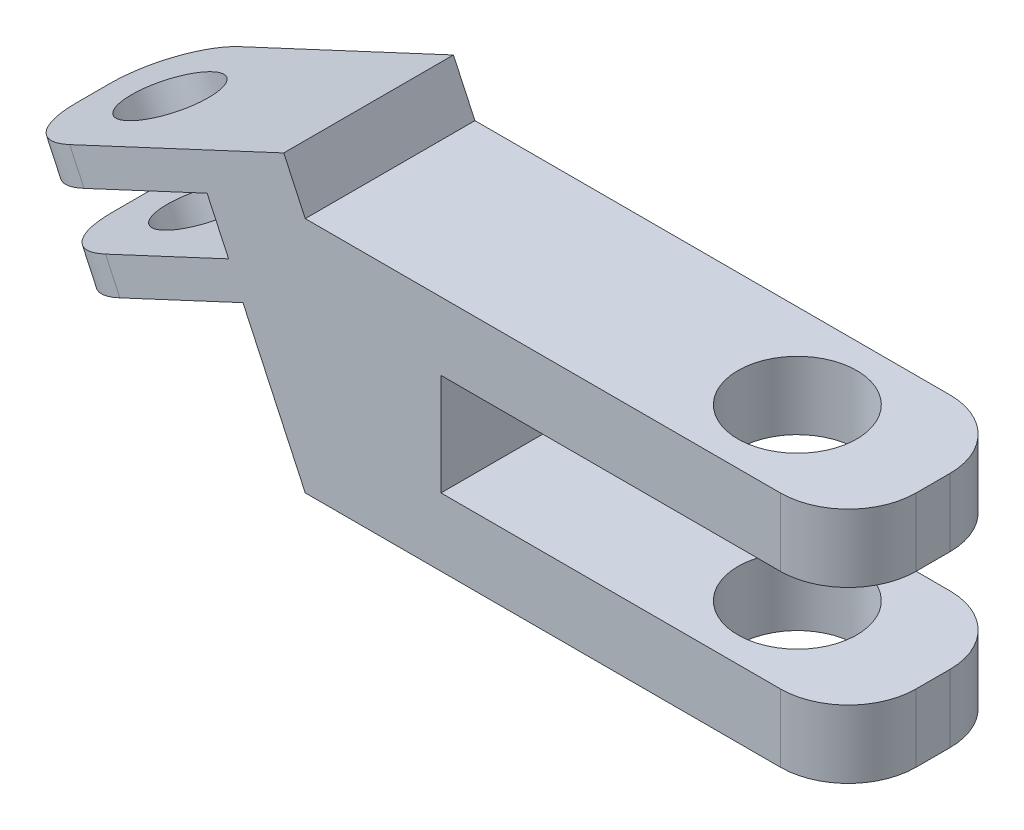
ISO-10303-21;
HEADER;
FILE_DESCRIPTION(('STEP AP214'),'2;1');
FILE_NAME('part.step','',(''),(''),'','','');
FILE_SCHEMA(('AUTOMOTIVE_DESIGN { 1 0 10303 214 1 1 1 1 }'));
ENDSEC;
DATA;
#1=APPLICATION_CONTEXT('core data for automotive mechanical design processes');
#2=APPLICATION_PROTOCOL_DEFINITION('international standard','automotive_design',2000,#1);
#3=PRODUCT_CONTEXT('',#1,'mechanical');
#4=PRODUCT('Part','Part','',(#3));
#5=PRODUCT_RELATED_PRODUCT_CATEGORY('part','',(#4));
#6=PRODUCT_DEFINITION_FORMATION('','',#4);
#7=PRODUCT_DEFINITION_CONTEXT('part definition',#1,'design');
#8=PRODUCT_DEFINITION('design','',#6,#7);
#9=PRODUCT_DEFINITION_SHAPE('','',#8);
#10=(LENGTH_UNIT() NAMED_UNIT(*) SI_UNIT(.MILLI.,.METRE.));
#11=(NAMED_UNIT(*) PLANE_ANGLE_UNIT() SI_UNIT($,.RADIAN.));
#12=(NAMED_UNIT(*) SI_UNIT($,.STERADIAN.) SOLID_ANGLE_UNIT());
#13=UNCERTAINTY_MEASURE_WITH_UNIT(LENGTH_MEASURE(1.E-05),#10,'distance_accuracy_value','');
#14=(GEOMETRIC_REPRESENTATION_CONTEXT(3) GLOBAL_UNCERTAINTY_ASSIGNED_CONTEXT((#13)) GLOBAL_UNIT_ASSIGNED_CONTEXT((#10,
#11,#12)) REPRESENTATION_CONTEXT('',''));
#15=CARTESIAN_POINT('',(0.,0.,0.));
#16=DIRECTION('',(0.,0.,1.));
#17=DIRECTION('',(1.,0.,0.));
#18=AXIS2_PLACEMENT_3D('',#15,#16,#17);
#19=CARTESIAN_POINT('',(16.,0.,2.5));
#20=DIRECTION('',(1.,0.,0.));
#21=DIRECTION('',(0.,0.,-1.));
#22=AXIS2_PLACEMENT_3D('',#19,#20,#21);
#23=PLANE('',#22);
#24=DIRECTION('',(0.,0.,-1.));
#25=VECTOR('',#24,1.);
#26=CARTESIAN_POINT('',(16.,-1.5,2.5));
#27=LINE('',#26,#25);
#28=CARTESIAN_POINT('',(16.,-1.5,0.5));
#29=VERTEX_POINT('',#28);
#30=CARTESIAN_POINT('',(16.,-1.5,-0.5));
#31=VERTEX_POINT('',#30);
#32=EDGE_CURVE('E220',#29,#31,#27,.T.);
#33=ORIENTED_EDGE('',*,*,#32,.F.);
#34=DIRECTION('',(0.,-1.,0.));
#35=VECTOR('',#34,1.);
#36=CARTESIAN_POINT('',(16.,0.,0.5));
#37=LINE('',#36,#35);
#38=CARTESIAN_POINT('',(16.,-3.5,0.5));
#39=VERTEX_POINT('',#38);
#40=EDGE_CURVE('E322',#29,#39,#37,.T.);
#41=ORIENTED_EDGE('',*,*,#40,.T.);
#42=DIRECTION('',(0.,0.,-1.));
#43=VECTOR('',#42,1.);
#44=CARTESIAN_POINT('',(16.,-3.5,2.5));
#45=LINE('',#44,#43);
#46=CARTESIAN_POINT('',(16.,-3.5,-0.5));
#47=VERTEX_POINT('',#46);
#48=EDGE_CURVE('E252',#39,#47,#45,.T.);
#49=ORIENTED_EDGE('',*,*,#48,.T.);
#50=DIRECTION('',(0.,-1.,0.));
#51=VECTOR('',#50,1.);
#52=CARTESIAN_POINT('',(16.,-1.5,-0.5));
#53=LINE('',#52,#51);
#54=EDGE_CURVE('E320',#47,#31,#53,.F.);
#55=ORIENTED_EDGE('',*,*,#54,.T.);
#56=EDGE_LOOP('',(#33,#41,#49,#55));
#57=FACE_BOUND('',#56,.T.);
#58=ADVANCED_FACE('F39',(#57),#23,.T.);
#59=CARTESIAN_POINT('',(0.,-1.5,2.5));
#60=DIRECTION('',(0.,-1.,0.));
#61=DIRECTION('',(0.,0.,-1.));
#62=AXIS2_PLACEMENT_3D('',#59,#60,#61);
#63=PLANE('',#62);
#64=CARTESIAN_POINT('',(12.,-1.5,0.));
#65=DIRECTION('',(0.,-1.,0.));
#66=DIRECTION('',(0.,0.,-1.));
#67=AXIS2_PLACEMENT_3D('',#64,#65,#66);
#68=CIRCLE('',#67,1.75);
#69=CARTESIAN_POINT('',(12.,-1.5,-1.75));
#70=VERTEX_POINT('',#69);
#71=EDGE_CURVE('E808',#70,#70,#68,.T.);
#72=ORIENTED_EDGE('',*,*,#71,.T.);
#73=EDGE_LOOP('',(#72));
#74=FACE_BOUND('',#73,.T.);
#75=DIRECTION('',(-1.,0.,0.));
#76=VECTOR('',#75,1.);
#77=CARTESIAN_POINT('',(0.,-1.5,2.5));
#78=LINE('',#77,#76);
#79=CARTESIAN_POINT('',(14.,-1.5,2.5));
#80=VERTEX_POINT('',#79);
#81=CARTESIAN_POINT('',(4.,-1.5,2.5));
#82=VERTEX_POINT('',#81);
#83=EDGE_CURVE('E199',#80,#82,#78,.T.);
#84=ORIENTED_EDGE('',*,*,#83,.F.);
#85=CARTESIAN_POINT('',(14.,-1.5,0.5));
#86=DIRECTION('',(0.,-1.,0.));
#87=DIRECTION('',(0.,0.,-1.));
#88=AXIS2_PLACEMENT_3D('',#85,#86,#87);
#89=CIRCLE('',#88,2.);
#90=EDGE_CURVE('E340',#80,#29,#89,.F.);
#91=ORIENTED_EDGE('',*,*,#90,.T.);
#92=ORIENTED_EDGE('',*,*,#32,.T.);
#93=CARTESIAN_POINT('',(14.,-1.5,-0.5));
#94=DIRECTION('',(0.,-1.,0.));
#95=DIRECTION('',(0.,0.,-1.));
#96=AXIS2_PLACEMENT_3D('',#93,#94,#95);
#97=CIRCLE('',#96,2.);
#98=CARTESIAN_POINT('',(14.,-1.5,-2.5));
#99=VERTEX_POINT('',#98);
#100=EDGE_CURVE('E338',#31,#99,#97,.F.);
#101=ORIENTED_EDGE('',*,*,#100,.T.);
#102=DIRECTION('',(-1.,0.,0.));
#103=VECTOR('',#102,1.);
#104=CARTESIAN_POINT('',(0.,-1.5,-2.5));
#105=LINE('',#104,#103);
#106=CARTESIAN_POINT('',(4.,-1.5,-2.5));
#107=VERTEX_POINT('',#106);
#108=EDGE_CURVE('E217',#99,#107,#105,.T.);
#109=ORIENTED_EDGE('',*,*,#108,.T.);
#110=DIRECTION('',(0.,0.,-1.));
#111=VECTOR('',#110,1.);
#112=CARTESIAN_POINT('',(4.,-1.5,2.5));
#113=LINE('',#112,#111);
#114=EDGE_CURVE('E214',#82,#107,#113,.T.);
#115=ORIENTED_EDGE('',*,*,#114,.F.);
#116=EDGE_LOOP('',(#84,#91,#92,#101,#109,#115));
#117=FACE_BOUND('',#116,.T.);
#118=ADVANCED_FACE('F215',(#74,#117),#63,.F.);
#119=CARTESIAN_POINT('',(4.,0.,2.5));
#120=DIRECTION('',(-1.,0.,0.));
#121=DIRECTION('',(0.,0.,1.));
#122=AXIS2_PLACEMENT_3D('',#119,#120,#121);
#123=PLANE('',#122);
#124=DIRECTION('',(0.,1.,0.));
#125=VECTOR('',#124,1.);
#126=CARTESIAN_POINT('',(4.,0.,-2.5));
#127=LINE('',#126,#125);
#128=CARTESIAN_POINT('',(4.,1.5,-2.5));
#129=VERTEX_POINT('',#128);
#130=EDGE_CURVE('E254',#107,#129,#127,.T.);
#131=ORIENTED_EDGE('',*,*,#130,.T.);
#132=DIRECTION('',(0.,0.,-1.));
#133=VECTOR('',#132,1.);
#134=CARTESIAN_POINT('',(4.,1.5,2.5));
#135=LINE('',#134,#133);
#136=CARTESIAN_POINT('',(4.,1.5,2.5));
#137=VERTEX_POINT('',#136);
#138=EDGE_CURVE('E221',#137,#129,#135,.T.);
#139=ORIENTED_EDGE('',*,*,#138,.F.);
#140=DIRECTION('',(0.,1.,0.));
#141=VECTOR('',#140,1.);
#142=CARTESIAN_POINT('',(4.,0.,2.5));
#143=LINE('',#142,#141);
#144=EDGE_CURVE('E205',#82,#137,#143,.T.);
#145=ORIENTED_EDGE('',*,*,#144,.F.);
#146=ORIENTED_EDGE('',*,*,#114,.T.);
#147=EDGE_LOOP('',(#131,#139,#145,#146));
#148=FACE_BOUND('',#147,.T.);
#149=ADVANCED_FACE('F223',(#148),#123,.F.);
#150=CARTESIAN_POINT('',(0.,1.5,2.5));
#151=DIRECTION('',(0.,1.,0.));
#152=DIRECTION('',(0.,0.,1.));
#153=AXIS2_PLACEMENT_3D('',#150,#151,#152);
#154=PLANE('',#153);
#155=CARTESIAN_POINT('',(12.,1.5,0.));
#156=DIRECTION('',(0.,1.,0.));
#157=DIRECTION('',(0.,0.,1.));
#158=AXIS2_PLACEMENT_3D('',#155,#156,#157);
#159=CIRCLE('',#158,1.75);
#160=CARTESIAN_POINT('',(12.,1.5,1.75));
#161=VERTEX_POINT('',#160);
#162=EDGE_CURVE('E817',#161,#161,#159,.T.);
#163=ORIENTED_EDGE('',*,*,#162,.T.);
#164=EDGE_LOOP('',(#163));
#165=FACE_BOUND('',#164,.T.);
#166=DIRECTION('',(1.,0.,0.));
#167=VECTOR('',#166,1.);
#168=CARTESIAN_POINT('',(0.,1.5,-2.5));
#169=LINE('',#168,#167);
#170=CARTESIAN_POINT('',(14.,1.5,-2.5));
#171=VERTEX_POINT('',#170);
#172=EDGE_CURVE('E257',#129,#171,#169,.T.);
#173=ORIENTED_EDGE('',*,*,#172,.T.);
#174=CARTESIAN_POINT('',(14.,1.5,-0.5));
#175=DIRECTION('',(0.,1.,0.));
#176=DIRECTION('',(0.,0.,1.));
#177=AXIS2_PLACEMENT_3D('',#174,#175,#176);
#178=CIRCLE('',#177,2.);
#179=CARTESIAN_POINT('',(16.,1.5,-0.5));
#180=VERTEX_POINT('',#179);
#181=EDGE_CURVE('E354',#171,#180,#178,.F.);
#182=ORIENTED_EDGE('',*,*,#181,.T.);
#183=DIRECTION('',(0.,0.,-1.));
#184=VECTOR('',#183,1.);
#185=CARTESIAN_POINT('',(16.,1.5,2.5));
#186=LINE('',#185,#184);
#187=CARTESIAN_POINT('',(16.,1.5,0.5));
#188=VERTEX_POINT('',#187);
#189=EDGE_CURVE('E314',#188,#180,#186,.T.);
#190=ORIENTED_EDGE('',*,*,#189,.F.);
#191=CARTESIAN_POINT('',(14.,1.5,0.5));
#192=DIRECTION('',(0.,1.,0.));
#193=DIRECTION('',(0.,0.,1.));
#194=AXIS2_PLACEMENT_3D('',#191,#192,#193);
#195=CIRCLE('',#194,2.);
#196=CARTESIAN_POINT('',(14.,1.5,2.5));
#197=VERTEX_POINT('',#196);
#198=EDGE_CURVE('E352',#188,#197,#195,.F.);
#199=ORIENTED_EDGE('',*,*,#198,.T.);
#200=DIRECTION('',(1.,0.,0.));
#201=VECTOR('',#200,1.);
#202=CARTESIAN_POINT('',(0.,1.5,2.5));
#203=LINE('',#202,#201);
#204=EDGE_CURVE('E226',#137,#197,#203,.T.);
#205=ORIENTED_EDGE('',*,*,#204,.F.);
#206=ORIENTED_EDGE('',*,*,#138,.T.);
#207=EDGE_LOOP('',(#173,#182,#190,#199,#205,#206));
#208=FACE_BOUND('',#207,.T.);
#209=ADVANCED_FACE('F455',(#165,#208),#154,.F.);
#210=CARTESIAN_POINT('',(16.,0.,2.5));
#211=DIRECTION('',(1.,0.,0.));
#212=DIRECTION('',(0.,0.,-1.));
#213=AXIS2_PLACEMENT_3D('',#210,#211,#212);
#214=PLANE('',#213);
#215=ORIENTED_EDGE('',*,*,#189,.T.);
#216=DIRECTION('',(0.,-1.,0.));
#217=VECTOR('',#216,1.);
#218=CARTESIAN_POINT('',(16.,3.5,-0.5));
#219=LINE('',#218,#217);
#220=CARTESIAN_POINT('',(16.,3.5,-0.5));
#221=VERTEX_POINT('',#220);
#222=EDGE_CURVE('E359',#180,#221,#219,.F.);
#223=ORIENTED_EDGE('',*,*,#222,.T.);
#224=DIRECTION('',(0.,0.,-1.));
#225=VECTOR('',#224,1.);
#226=CARTESIAN_POINT('',(16.,3.5,2.5));
#227=LINE('',#226,#225);
#228=CARTESIAN_POINT('',(16.,3.5,0.5));
#229=VERTEX_POINT('',#228);
#230=EDGE_CURVE('E311',#229,#221,#227,.T.);
#231=ORIENTED_EDGE('',*,*,#230,.F.);
#232=DIRECTION('',(0.,-1.,0.));
#233=VECTOR('',#232,1.);
#234=CARTESIAN_POINT('',(16.,0.,0.5));
#235=LINE('',#234,#233);
#236=EDGE_CURVE('E356',#229,#188,#235,.T.);
#237=ORIENTED_EDGE('',*,*,#236,.T.);
#238=EDGE_LOOP('',(#215,#223,#231,#237));
#239=FACE_BOUND('',#238,.T.);
#240=ADVANCED_FACE('F467',(#239),#214,.T.);
#241=CARTESIAN_POINT('',(0.,3.5,2.5));
#242=DIRECTION('',(0.,1.,0.));
#243=DIRECTION('',(0.,0.,1.));
#244=AXIS2_PLACEMENT_3D('',#241,#242,#243);
#245=PLANE('',#244);
#246=CARTESIAN_POINT('',(12.,3.49999999999999,0.));
#247=DIRECTION('',(0.,1.,0.));
#248=DIRECTION('',(-1.,0.,0.));
#249=AXIS2_PLACEMENT_3D('',#246,#247,#248);
#250=CIRCLE('',#249,1.75);
#251=CARTESIAN_POINT('',(10.25,3.49999999999999,0.));
#252=VERTEX_POINT('',#251);
#253=EDGE_CURVE('E821',#252,#252,#250,.T.);
#254=ORIENTED_EDGE('',*,*,#253,.F.);
#255=EDGE_LOOP('',(#254));
#256=FACE_BOUND('',#255,.T.);
#257=ORIENTED_EDGE('',*,*,#230,.T.);
#258=CARTESIAN_POINT('',(14.,3.5,-0.5));
#259=DIRECTION('',(0.,1.,0.));
#260=DIRECTION('',(0.,0.,1.));
#261=AXIS2_PLACEMENT_3D('',#258,#259,#260);
#262=CIRCLE('',#261,2.);
#263=CARTESIAN_POINT('',(14.,3.5,-2.5));
#264=VERTEX_POINT('',#263);
#265=EDGE_CURVE('E363',#221,#264,#262,.T.);
#266=ORIENTED_EDGE('',*,*,#265,.T.);
#267=DIRECTION('',(1.,0.,0.));
#268=VECTOR('',#267,1.);
#269=CARTESIAN_POINT('',(0.,3.5,-2.5));
#270=LINE('',#269,#268);
#271=CARTESIAN_POINT('',(0.,3.5,-2.5));
#272=VERTEX_POINT('',#271);
#273=EDGE_CURVE('E260',#272,#264,#270,.T.);
#274=ORIENTED_EDGE('',*,*,#273,.F.);
#275=DIRECTION('',(0.,0.,-1.));
#276=VECTOR('',#275,1.);
#277=CARTESIAN_POINT('',(0.,3.5,2.5));
#278=LINE('',#277,#276);
#279=CARTESIAN_POINT('',(0.,3.5,2.5));
#280=VERTEX_POINT('',#279);
#281=EDGE_CURVE('E309',#280,#272,#278,.T.);
#282=ORIENTED_EDGE('',*,*,#281,.F.);
#283=DIRECTION('',(1.,0.,0.));
#284=VECTOR('',#283,1.);
#285=CARTESIAN_POINT('',(0.,3.5,2.5));
#286=LINE('',#285,#284);
#287=CARTESIAN_POINT('',(14.,3.5,2.5));
#288=VERTEX_POINT('',#287);
#289=EDGE_CURVE('E228',#280,#288,#286,.T.);
#290=ORIENTED_EDGE('',*,*,#289,.T.);
#291=CARTESIAN_POINT('',(14.,3.5,0.5));
#292=DIRECTION('',(0.,1.,0.));
#293=DIRECTION('',(0.,0.,1.));
#294=AXIS2_PLACEMENT_3D('',#291,#292,#293);
#295=CIRCLE('',#294,2.);
#296=EDGE_CURVE('E361',#288,#229,#295,.T.);
#297=ORIENTED_EDGE('',*,*,#296,.T.);
#298=EDGE_LOOP('',(#257,#266,#274,#282,#290,#297));
#299=FACE_BOUND('',#298,.T.);
#300=ADVANCED_FACE('F464',(#256,#299),#245,.T.);
#301=CARTESIAN_POINT('',(1.3405777754582,0.625121683048543,2.5));
#302=DIRECTION('',(0.906307787036652,0.422618261740695,0.));
#303=DIRECTION('',(-0.422618261740695,0.906307787036652,0.));
#304=AXIS2_PLACEMENT_3D('',#301,#302,#303);
#305=PLANE('',#304);
#306=DIRECTION('',(0.422618261740695,-0.906307787036652,0.));
#307=VECTOR('',#306,1.);
#308=CARTESIAN_POINT('',(1.3405777754582,0.625121683048543,-2.5));
#309=LINE('',#308,#307);
#310=CARTESIAN_POINT('',(-0.633927392611042,4.85946168055498,-2.5));
#311=VERTEX_POINT('',#310);
#312=EDGE_CURVE('E263',#311,#272,#309,.T.);
#313=ORIENTED_EDGE('',*,*,#312,.F.);
#314=DIRECTION('',(0.,0.,-1.));
#315=VECTOR('',#314,1.);
#316=CARTESIAN_POINT('',(-0.633927392611042,4.85946168055498,2.5));
#317=LINE('',#316,#315);
#318=CARTESIAN_POINT('',(-0.633927392611042,4.85946168055498,2.5));
#319=VERTEX_POINT('',#318);
#320=EDGE_CURVE('E306',#319,#311,#317,.T.);
#321=ORIENTED_EDGE('',*,*,#320,.F.);
#322=DIRECTION('',(0.422618261740695,-0.906307787036652,0.));
#323=VECTOR('',#322,1.);
#324=CARTESIAN_POINT('',(1.3405777754582,0.625121683048543,2.5));
#325=LINE('',#324,#323);
#326=EDGE_CURVE('E234',#319,#280,#325,.T.);
#327=ORIENTED_EDGE('',*,*,#326,.T.);
#328=ORIENTED_EDGE('',*,*,#281,.T.);
#329=EDGE_LOOP('',(#313,#321,#327,#328));
#330=FACE_BOUND('',#329,.T.);
#331=ADVANCED_FACE('F475',(#330),#305,.T.);
#332=CARTESIAN_POINT('',(-1.97450516806924,4.23433999750644,2.5));
#333=DIRECTION('',(-0.422618261740695,0.906307787036652,0.));
#334=DIRECTION('',(-0.906307787036652,-0.422618261740695,0.));
#335=AXIS2_PLACEMENT_3D('',#332,#333,#334);
#336=PLANE('',#335);
#337=CARTESIAN_POINT('',(-6.48716019815572,2.13005439836546,0.));
#338=DIRECTION('',(-0.422618261740695,0.906307787036652,0.));
#339=DIRECTION('',(-0.906307787036652,-0.422618261740695,0.));
#340=AXIS2_PLACEMENT_3D('',#337,#338,#339);
#341=CIRCLE('',#340,1.25);
#342=CARTESIAN_POINT('',(-7.62004493195154,1.6017815711896,0.));
#343=VERTEX_POINT('',#342);
#344=EDGE_CURVE('E255',#343,#343,#341,.T.);
#345=ORIENTED_EDGE('',*,*,#344,.F.);
#346=EDGE_LOOP('',(#345));
#347=FACE_BOUND('',#346,.T.);
#348=DIRECTION('',(0.906307787036652,0.422618261740695,0.));
#349=VECTOR('',#348,1.);
#350=CARTESIAN_POINT('',(-1.97450516806924,4.23433999750644,-2.5));
#351=LINE('',#350,#349);
#352=CARTESIAN_POINT('',(-6.94031409167405,1.91874526749511,-2.5));
#353=VERTEX_POINT('',#352);
#354=EDGE_CURVE('E266',#353,#311,#351,.T.);
#355=ORIENTED_EDGE('',*,*,#354,.F.);
#356=CARTESIAN_POINT('',(-6.94031409167405,1.91874526749512,-0.5));
#357=DIRECTION('',(-0.422618261740695,0.906307787036652,0.));
#358=DIRECTION('',(-0.906307787036652,-0.422618261740695,0.));
#359=AXIS2_PLACEMENT_3D('',#356,#357,#358);
#360=CIRCLE('',#359,2.);
#361=CARTESIAN_POINT('',(-8.75292966574735,1.07350874401373,-0.5));
#362=VERTEX_POINT('',#361);
#363=EDGE_CURVE('E11',#353,#362,#360,.T.);
#364=ORIENTED_EDGE('',*,*,#363,.T.);
#365=DIRECTION('',(0.,0.,-1.));
#366=VECTOR('',#365,1.);
#367=CARTESIAN_POINT('',(-8.75292966574735,1.07350874401373,2.5));
#368=LINE('',#367,#366);
#369=CARTESIAN_POINT('',(-8.75292966574735,1.07350874401373,0.5));
#370=VERTEX_POINT('',#369);
#371=EDGE_CURVE('E304',#370,#362,#368,.T.);
#372=ORIENTED_EDGE('',*,*,#371,.F.);
#373=CARTESIAN_POINT('',(-6.94031409167405,1.91874526749512,0.5));
#374=DIRECTION('',(-0.422618261740695,0.906307787036652,0.));
#375=DIRECTION('',(-0.906307787036652,-0.422618261740695,0.));
#376=AXIS2_PLACEMENT_3D('',#373,#374,#375);
#377=CIRCLE('',#376,2.);
#378=CARTESIAN_POINT('',(-6.94031409167405,1.91874526749511,2.5));
#379=VERTEX_POINT('',#378);
#380=EDGE_CURVE('E47',#370,#379,#377,.T.);
#381=ORIENTED_EDGE('',*,*,#380,.T.);
#382=DIRECTION('',(0.906307787036652,0.422618261740695,0.));
#383=VECTOR('',#382,1.);
#384=CARTESIAN_POINT('',(-1.97450516806924,4.23433999750644,2.5));
#385=LINE('',#384,#383);
#386=EDGE_CURVE('E237',#379,#319,#385,.T.);
#387=ORIENTED_EDGE('',*,*,#386,.T.);
#388=ORIENTED_EDGE('',*,*,#320,.T.);
#389=EDGE_LOOP('',(#355,#364,#372,#381,#387,#388));
#390=FACE_BOUND('',#389,.T.);
#391=ADVANCED_FACE('F387',(#347,#390),#336,.T.);
#392=CARTESIAN_POINT('',(-6.77842449767811,-3.16083125349271,2.5));
#393=DIRECTION('',(0.906307787036652,0.422618261740695,0.));
#394=DIRECTION('',(-0.422618261740695,0.906307787036652,0.));
#395=AXIS2_PLACEMENT_3D('',#392,#393,#394);
#396=PLANE('',#395);
#397=ORIENTED_EDGE('',*,*,#371,.T.);
#398=DIRECTION('',(0.422618261740695,-0.906307787036652,0.));
#399=VECTOR('',#398,1.);
#400=CARTESIAN_POINT('',(-6.77842449767811,-3.16083125349271,-0.5));
#401=LINE('',#400,#399);
#402=CARTESIAN_POINT('',(-8.33031140400666,0.167200956977075,-0.5));
#403=VERTEX_POINT('',#402);
#404=EDGE_CURVE('E379',#362,#403,#401,.T.);
#405=ORIENTED_EDGE('',*,*,#404,.T.);
#406=DIRECTION('',(0.,0.,-1.));
#407=VECTOR('',#406,1.);
#408=CARTESIAN_POINT('',(-8.33031140400666,0.167200956977075,2.5));
#409=LINE('',#408,#407);
#410=CARTESIAN_POINT('',(-8.33031140400666,0.167200956977075,0.5));
#411=VERTEX_POINT('',#410);
#412=EDGE_CURVE('E301',#411,#403,#409,.T.);
#413=ORIENTED_EDGE('',*,*,#412,.F.);
#414=DIRECTION('',(0.422618261740695,-0.906307787036652,0.));
#415=VECTOR('',#414,1.);
#416=CARTESIAN_POINT('',(-8.75292966574735,1.07350874401373,0.5));
#417=LINE('',#416,#415);
#418=EDGE_CURVE('E59',#411,#370,#417,.F.);
#419=ORIENTED_EDGE('',*,*,#418,.T.);
#420=EDGE_LOOP('',(#397,#405,#413,#419));
#421=FACE_BOUND('',#420,.T.);
#422=ADVANCED_FACE('F397',(#421),#396,.F.);
#423=CARTESIAN_POINT('',(-1.55188690632855,3.32803221046979,2.5));
#424=DIRECTION('',(-0.422618261740695,0.906307787036652,0.));
#425=DIRECTION('',(-0.906307787036652,-0.422618261740695,0.));
#426=AXIS2_PLACEMENT_3D('',#423,#424,#425);
#427=PLANE('',#426);
#428=CARTESIAN_POINT('',(-6.06454193641503,1.22374661132881,0.));
#429=DIRECTION('',(-0.422618261740695,0.906307787036652,0.));
#430=DIRECTION('',(-0.906307787036652,-0.422618261740695,0.));
#431=AXIS2_PLACEMENT_3D('',#428,#429,#430);
#432=CIRCLE('',#431,1.25);
#433=CARTESIAN_POINT('',(-7.19742667021084,0.695473784152945,0.));
#434=VERTEX_POINT('',#433);
#435=EDGE_CURVE('E804',#434,#434,#432,.T.);
#436=ORIENTED_EDGE('',*,*,#435,.T.);
#437=EDGE_LOOP('',(#436));
#438=FACE_BOUND('',#437,.T.);
#439=ORIENTED_EDGE('',*,*,#412,.T.);
#440=CARTESIAN_POINT('',(-6.51769582993336,1.01243748045847,-0.5));
#441=DIRECTION('',(-0.422618261740695,0.906307787036652,0.));
#442=DIRECTION('',(-0.906307787036652,-0.422618261740695,0.));
#443=AXIS2_PLACEMENT_3D('',#440,#441,#442);
#444=CIRCLE('',#443,2.);
#445=CARTESIAN_POINT('',(-6.51769582993336,1.01243748045846,-2.5));
#446=VERTEX_POINT('',#445);
#447=EDGE_CURVE('E384',#403,#446,#444,.F.);
#448=ORIENTED_EDGE('',*,*,#447,.T.);
#449=DIRECTION('',(0.906307787036652,0.422618261740695,0.));
#450=VECTOR('',#449,1.);
#451=CARTESIAN_POINT('',(-1.55188690632855,3.32803221046979,-2.5));
#452=LINE('',#451,#450);
#453=CARTESIAN_POINT('',(-2.89246468178675,2.70291052742124,-2.5));
#454=VERTEX_POINT('',#453);
#455=EDGE_CURVE('E268',#446,#454,#452,.T.);
#456=ORIENTED_EDGE('',*,*,#455,.T.);
#457=DIRECTION('',(0.,0.,-1.));
#458=VECTOR('',#457,1.);
#459=CARTESIAN_POINT('',(-2.89246468178675,2.70291052742124,2.5));
#460=LINE('',#459,#458);
#461=CARTESIAN_POINT('',(-2.89246468178675,2.70291052742124,2.5));
#462=VERTEX_POINT('',#461);
#463=EDGE_CURVE('E298',#462,#454,#460,.T.);
#464=ORIENTED_EDGE('',*,*,#463,.F.);
#465=DIRECTION('',(0.906307787036652,0.422618261740695,0.));
#466=VECTOR('',#465,1.);
#467=CARTESIAN_POINT('',(-1.55188690632855,3.32803221046979,2.5));
#468=LINE('',#467,#466);
#469=CARTESIAN_POINT('',(-6.51769582993336,1.01243748045846,2.5));
#470=VERTEX_POINT('',#469);
#471=EDGE_CURVE('E239',#470,#462,#468,.T.);
#472=ORIENTED_EDGE('',*,*,#471,.F.);
#473=CARTESIAN_POINT('',(-6.51769582993336,1.01243748045847,0.5));
#474=DIRECTION('',(-0.422618261740695,0.906307787036652,0.));
#475=DIRECTION('',(-0.906307787036652,-0.422618261740695,0.));
#476=AXIS2_PLACEMENT_3D('',#473,#474,#475);
#477=CIRCLE('',#476,2.);
#478=EDGE_CURVE('E382',#470,#411,#477,.F.);
#479=ORIENTED_EDGE('',*,*,#478,.T.);
#480=EDGE_LOOP('',(#439,#448,#456,#464,#472,#479));
#481=FACE_BOUND('',#480,.T.);
#482=ADVANCED_FACE('F395',(#438,#481),#427,.F.);
#483=CARTESIAN_POINT('',(-1.3405777754582,-0.625121683048543,2.5));
#484=DIRECTION('',(0.906307787036652,0.422618261740695,0.));
#485=DIRECTION('',(-0.422618261740695,0.906307787036652,0.));
#486=AXIS2_PLACEMENT_3D('',#483,#484,#485);
#487=PLANE('',#486);
#488=DIRECTION('',(0.422618261740695,-0.906307787036652,0.));
#489=VECTOR('',#488,1.);
#490=CARTESIAN_POINT('',(-1.3405777754582,-0.625121683048543,-2.5));
#491=LINE('',#490,#489);
#492=CARTESIAN_POINT('',(-2.25853728917571,1.34344884686626,-2.5));
#493=VERTEX_POINT('',#492);
#494=EDGE_CURVE('E270',#454,#493,#491,.T.);
#495=ORIENTED_EDGE('',*,*,#494,.T.);
#496=DIRECTION('',(0.,0.,-1.));
#497=VECTOR('',#496,1.);
#498=CARTESIAN_POINT('',(-2.25853728917571,1.34344884686626,2.5));
#499=LINE('',#498,#497);
#500=CARTESIAN_POINT('',(-2.25853728917571,1.34344884686626,2.5));
#501=VERTEX_POINT('',#500);
#502=EDGE_CURVE('E295',#501,#493,#499,.T.);
#503=ORIENTED_EDGE('',*,*,#502,.F.);
#504=DIRECTION('',(0.422618261740695,-0.906307787036652,0.));
#505=VECTOR('',#504,1.);
#506=CARTESIAN_POINT('',(-1.3405777754582,-0.625121683048543,2.5));
#507=LINE('',#506,#505);
#508=EDGE_CURVE('E241',#462,#501,#507,.T.);
#509=ORIENTED_EDGE('',*,*,#508,.F.);
#510=ORIENTED_EDGE('',*,*,#463,.T.);
#511=EDGE_LOOP('',(#495,#503,#509,#510));
#512=FACE_BOUND('',#511,.T.);
#513=ADVANCED_FACE('F409',(#512),#487,.F.);
#514=CARTESIAN_POINT('',(-0.917959513717507,1.96857052991481,2.5));
#515=DIRECTION('',(0.422618261740695,-0.906307787036652,0.));
#516=DIRECTION('',(0.906307787036652,0.422618261740695,0.));
#517=AXIS2_PLACEMENT_3D('',#514,#515,#516);
#518=PLANE('',#517);
#519=CARTESIAN_POINT('',(-5.43061454380399,-0.135715069226168,0.));
#520=DIRECTION('',(0.422618261740695,-0.906307787036652,0.));
#521=DIRECTION('',(0.906307787036652,0.422618261740695,0.));
#522=AXIS2_PLACEMENT_3D('',#519,#520,#521);
#523=CIRCLE('',#522,1.25);
#524=CARTESIAN_POINT('',(-4.29772981000817,0.392557757949701,0.));
#525=VERTEX_POINT('',#524);
#526=EDGE_CURVE('E803',#525,#525,#523,.T.);
#527=ORIENTED_EDGE('',*,*,#526,.T.);
#528=EDGE_LOOP('',(#527));
#529=FACE_BOUND('',#528,.T.);
#530=DIRECTION('',(-0.906307787036652,-0.422618261740695,0.));
#531=VECTOR('',#530,1.);
#532=CARTESIAN_POINT('',(-0.917959513717507,1.96857052991481,-2.5));
#533=LINE('',#532,#531);
#534=CARTESIAN_POINT('',(-5.88376843732231,-0.347024200096515,-2.5));
#535=VERTEX_POINT('',#534);
#536=EDGE_CURVE('E272',#493,#535,#533,.T.);
#537=ORIENTED_EDGE('',*,*,#536,.T.);
#538=CARTESIAN_POINT('',(-5.88376843732231,-0.347024200096516,-0.5));
#539=DIRECTION('',(0.422618261740695,-0.906307787036652,0.));
#540=DIRECTION('',(0.906307787036652,0.422618261740695,0.));
#541=AXIS2_PLACEMENT_3D('',#538,#539,#540);
#542=CIRCLE('',#541,2.);
#543=CARTESIAN_POINT('',(-7.69638401139562,-1.19226072357791,-0.5));
#544=VERTEX_POINT('',#543);
#545=EDGE_CURVE('E376',#535,#544,#542,.F.);
#546=ORIENTED_EDGE('',*,*,#545,.T.);
#547=DIRECTION('',(0.,0.,-1.));
#548=VECTOR('',#547,1.);
#549=CARTESIAN_POINT('',(-7.69638401139562,-1.19226072357791,2.5));
#550=LINE('',#549,#548);
#551=CARTESIAN_POINT('',(-7.69638401139562,-1.19226072357791,0.5));
#552=VERTEX_POINT('',#551);
#553=EDGE_CURVE('E292',#552,#544,#550,.T.);
#554=ORIENTED_EDGE('',*,*,#553,.F.);
#555=CARTESIAN_POINT('',(-5.88376843732231,-0.347024200096515,0.5));
#556=DIRECTION('',(0.422618261740695,-0.906307787036652,0.));
#557=DIRECTION('',(0.906307787036652,0.422618261740695,0.));
#558=AXIS2_PLACEMENT_3D('',#555,#556,#557);
#559=CIRCLE('',#558,2.);
#560=CARTESIAN_POINT('',(-5.88376843732231,-0.347024200096515,2.5));
#561=VERTEX_POINT('',#560);
#562=EDGE_CURVE('E374',#552,#561,#559,.F.);
#563=ORIENTED_EDGE('',*,*,#562,.T.);
#564=DIRECTION('',(-0.906307787036652,-0.422618261740695,0.));
#565=VECTOR('',#564,1.);
#566=CARTESIAN_POINT('',(-0.917959513717507,1.96857052991481,2.5));
#567=LINE('',#566,#565);
#568=EDGE_CURVE('E243',#501,#561,#567,.T.);
#569=ORIENTED_EDGE('',*,*,#568,.F.);
#570=ORIENTED_EDGE('',*,*,#502,.T.);
#571=EDGE_LOOP('',(#537,#546,#554,#563,#569,#570));
#572=FACE_BOUND('',#571,.T.);
#573=ADVANCED_FACE('F413',(#529,#572),#518,.F.);
#574=CARTESIAN_POINT('',(-6.77842449767812,-3.1608312534927,2.5));
#575=DIRECTION('',(0.906307787036653,0.422618261740693,0.));
#576=DIRECTION('',(-0.422618261740693,0.906307787036653,0.));
#577=AXIS2_PLACEMENT_3D('',#574,#575,#576);
#578=PLANE('',#577);
#579=ORIENTED_EDGE('',*,*,#553,.T.);
#580=DIRECTION('',(0.422618261740693,-0.906307787036653,0.));
#581=VECTOR('',#580,1.);
#582=CARTESIAN_POINT('',(-6.77842449767812,-3.1608312534927,-0.5));
#583=LINE('',#582,#581);
#584=CARTESIAN_POINT('',(-7.27376574965492,-2.09856851061456,-0.5));
#585=VERTEX_POINT('',#584);
#586=EDGE_CURVE('E367',#544,#585,#583,.T.);
#587=ORIENTED_EDGE('',*,*,#586,.T.);
#588=DIRECTION('',(0.,0.,-1.));
#589=VECTOR('',#588,1.);
#590=CARTESIAN_POINT('',(-7.27376574965492,-2.09856851061456,2.5));
#591=LINE('',#590,#589);
#592=CARTESIAN_POINT('',(-7.27376574965492,-2.09856851061456,0.5));
#593=VERTEX_POINT('',#592);
#594=EDGE_CURVE('E289',#593,#585,#591,.T.);
#595=ORIENTED_EDGE('',*,*,#594,.F.);
#596=DIRECTION('',(0.422618261740693,-0.906307787036653,0.));
#597=VECTOR('',#596,1.);
#598=CARTESIAN_POINT('',(-7.69638401139562,-1.19226072357791,0.5));
#599=LINE('',#598,#597);
#600=EDGE_CURVE('E365',#593,#552,#599,.F.);
#601=ORIENTED_EDGE('',*,*,#600,.T.);
#602=EDGE_LOOP('',(#579,#587,#595,#601));
#603=FACE_BOUND('',#602,.T.);
#604=ADVANCED_FACE('F427',(#603),#578,.F.);
#605=CARTESIAN_POINT('',(-0.495341251976811,1.06226274287815,2.5));
#606=DIRECTION('',(-0.422618261740695,0.906307787036652,0.));
#607=DIRECTION('',(-0.906307787036652,-0.422618261740695,0.));
#608=AXIS2_PLACEMENT_3D('',#605,#606,#607);
#609=PLANE('',#608);
#610=CARTESIAN_POINT('',(-5.00799628206329,-1.04202285626282,0.));
#611=DIRECTION('',(0.422618261740694,-0.906307787036652,0.));
#612=DIRECTION('',(0.906307787036652,0.422618261740694,0.));
#613=AXIS2_PLACEMENT_3D('',#610,#611,#612);
#614=CIRCLE('',#613,1.25);
#615=CARTESIAN_POINT('',(-3.87511154826748,-0.513750029086948,0.));
#616=VERTEX_POINT('',#615);
#617=EDGE_CURVE('E800',#616,#616,#614,.T.);
#618=ORIENTED_EDGE('',*,*,#617,.F.);
#619=EDGE_LOOP('',(#618));
#620=FACE_BOUND('',#619,.T.);
#621=ORIENTED_EDGE('',*,*,#594,.T.);
#622=CARTESIAN_POINT('',(-5.46115017558162,-1.25333198713317,-0.5));
#623=DIRECTION('',(-0.422618261740695,0.906307787036652,0.));
#624=DIRECTION('',(-0.906307787036652,-0.422618261740695,0.));
#625=AXIS2_PLACEMENT_3D('',#622,#623,#624);
#626=CIRCLE('',#625,2.);
#627=CARTESIAN_POINT('',(-5.46115017558162,-1.25333198713317,-2.5));
#628=VERTEX_POINT('',#627);
#629=EDGE_CURVE('E372',#585,#628,#626,.F.);
#630=ORIENTED_EDGE('',*,*,#629,.T.);
#631=DIRECTION('',(0.906307787036652,0.422618261740695,0.));
#632=VECTOR('',#631,1.);
#633=CARTESIAN_POINT('',(-0.495341251976811,1.06226274287815,-2.5));
#634=LINE('',#633,#632);
#635=CARTESIAN_POINT('',(-1.83591902743501,0.437141059829612,-2.5));
#636=VERTEX_POINT('',#635);
#637=EDGE_CURVE('E275',#628,#636,#634,.T.);
#638=ORIENTED_EDGE('',*,*,#637,.T.);
#639=DIRECTION('',(0.,0.,-1.));
#640=VECTOR('',#639,1.);
#641=CARTESIAN_POINT('',(-1.83591902743501,0.437141059829612,2.5));
#642=LINE('',#641,#640);
#643=CARTESIAN_POINT('',(-1.83591902743501,0.437141059829612,2.5));
#644=VERTEX_POINT('',#643);
#645=EDGE_CURVE('E286',#644,#636,#642,.T.);
#646=ORIENTED_EDGE('',*,*,#645,.F.);
#647=DIRECTION('',(0.906307787036652,0.422618261740695,0.));
#648=VECTOR('',#647,1.);
#649=CARTESIAN_POINT('',(-0.495341251976811,1.06226274287815,2.5));
#650=LINE('',#649,#648);
#651=CARTESIAN_POINT('',(-5.46115017558162,-1.25333198713317,2.5));
#652=VERTEX_POINT('',#651);
#653=EDGE_CURVE('E246',#652,#644,#650,.T.);
#654=ORIENTED_EDGE('',*,*,#653,.F.);
#655=CARTESIAN_POINT('',(-5.46115017558162,-1.25333198713317,0.5));
#656=DIRECTION('',(-0.422618261740695,0.906307787036652,0.));
#657=DIRECTION('',(-0.906307787036652,-0.422618261740695,0.));
#658=AXIS2_PLACEMENT_3D('',#655,#656,#657);
#659=CIRCLE('',#658,2.);
#660=EDGE_CURVE('E370',#652,#593,#659,.F.);
#661=ORIENTED_EDGE('',*,*,#660,.T.);
#662=EDGE_LOOP('',(#621,#630,#638,#646,#654,#661));
#663=FACE_BOUND('',#662,.T.);
#664=ADVANCED_FACE('F424',(#620,#663),#609,.F.);
#665=CARTESIAN_POINT('',(-1.3405777754582,-0.625121683048542,2.5));
#666=DIRECTION('',(0.906307787036652,0.422618261740695,0.));
#667=DIRECTION('',(-0.422618261740695,0.906307787036652,0.));
#668=AXIS2_PLACEMENT_3D('',#665,#666,#667);
#669=PLANE('',#668);
#670=DIRECTION('',(0.422618261740695,-0.906307787036652,0.));
#671=VECTOR('',#670,1.);
#672=CARTESIAN_POINT('',(-1.3405777754582,-0.625121683048542,-2.5));
#673=LINE('',#672,#671);
#674=CARTESIAN_POINT('',(0.,-3.5,-2.5));
#675=VERTEX_POINT('',#674);
#676=EDGE_CURVE('E277',#636,#675,#673,.T.);
#677=ORIENTED_EDGE('',*,*,#676,.T.);
#678=DIRECTION('',(0.,0.,-1.));
#679=VECTOR('',#678,1.);
#680=CARTESIAN_POINT('',(0.,-3.5,2.5));
#681=LINE('',#680,#679);
#682=CARTESIAN_POINT('',(0.,-3.5,2.5));
#683=VERTEX_POINT('',#682);
#684=EDGE_CURVE('E283',#683,#675,#681,.T.);
#685=ORIENTED_EDGE('',*,*,#684,.F.);
#686=DIRECTION('',(0.422618261740695,-0.906307787036652,0.));
#687=VECTOR('',#686,1.);
#688=CARTESIAN_POINT('',(-1.3405777754582,-0.625121683048542,2.5));
#689=LINE('',#688,#687);
#690=EDGE_CURVE('E248',#644,#683,#689,.T.);
#691=ORIENTED_EDGE('',*,*,#690,.F.);
#692=ORIENTED_EDGE('',*,*,#645,.T.);
#693=EDGE_LOOP('',(#677,#685,#691,#692));
#694=FACE_BOUND('',#693,.T.);
#695=ADVANCED_FACE('F437',(#694),#669,.F.);
#696=CARTESIAN_POINT('',(0.,-3.5,2.5));
#697=DIRECTION('',(0.,1.,0.));
#698=DIRECTION('',(0.,0.,1.));
#699=AXIS2_PLACEMENT_3D('',#696,#697,#698);
#700=PLANE('',#699);
#701=CARTESIAN_POINT('',(12.,-3.50000000000002,0.));
#702=DIRECTION('',(0.,1.,0.));
#703=DIRECTION('',(-1.,0.,0.));
#704=AXIS2_PLACEMENT_3D('',#701,#702,#703);
#705=CIRCLE('',#704,1.75);
#706=CARTESIAN_POINT('',(10.25,-3.50000000000002,0.));
#707=VERTEX_POINT('',#706);
#708=EDGE_CURVE('E820',#707,#707,#705,.T.);
#709=ORIENTED_EDGE('',*,*,#708,.T.);
#710=EDGE_LOOP('',(#709));
#711=FACE_BOUND('',#710,.T.);
#712=ORIENTED_EDGE('',*,*,#48,.F.);
#713=CARTESIAN_POINT('',(14.,-3.5,0.5));
#714=DIRECTION('',(0.,1.,0.));
#715=DIRECTION('',(0.,0.,1.));
#716=AXIS2_PLACEMENT_3D('',#713,#714,#715);
#717=CIRCLE('',#716,2.);
#718=CARTESIAN_POINT('',(14.,-3.5,2.5));
#719=VERTEX_POINT('',#718);
#720=EDGE_CURVE('E327',#39,#719,#717,.F.);
#721=ORIENTED_EDGE('',*,*,#720,.T.);
#722=DIRECTION('',(1.,0.,0.));
#723=VECTOR('',#722,1.);
#724=CARTESIAN_POINT('',(0.,-3.5,2.5));
#725=LINE('',#724,#723);
#726=EDGE_CURVE('E250',#683,#719,#725,.T.);
#727=ORIENTED_EDGE('',*,*,#726,.F.);
#728=ORIENTED_EDGE('',*,*,#684,.T.);
#729=DIRECTION('',(1.,0.,0.));
#730=VECTOR('',#729,1.);
#731=CARTESIAN_POINT('',(0.,-3.5,-2.5));
#732=LINE('',#731,#730);
#733=CARTESIAN_POINT('',(14.,-3.5,-2.5));
#734=VERTEX_POINT('',#733);
#735=EDGE_CURVE('E211',#675,#734,#732,.T.);
#736=ORIENTED_EDGE('',*,*,#735,.T.);
#737=CARTESIAN_POINT('',(14.,-3.5,-0.5));
#738=DIRECTION('',(0.,1.,0.));
#739=DIRECTION('',(0.,0.,1.));
#740=AXIS2_PLACEMENT_3D('',#737,#738,#739);
#741=CIRCLE('',#740,2.);
#742=EDGE_CURVE('E325',#734,#47,#741,.F.);
#743=ORIENTED_EDGE('',*,*,#742,.T.);
#744=EDGE_LOOP('',(#712,#721,#727,#728,#736,#743));
#745=FACE_BOUND('',#744,.T.);
#746=ADVANCED_FACE('F442',(#711,#745),#700,.F.);
#747=CARTESIAN_POINT('',(0.,0.,2.5));
#748=DIRECTION('',(0.,0.,1.));
#749=DIRECTION('',(1.,0.,0.));
#750=AXIS2_PLACEMENT_3D('',#747,#748,#749);
#751=PLANE('',#750);
#752=ORIENTED_EDGE('',*,*,#726,.T.);
#753=DIRECTION('',(0.,-1.,0.));
#754=VECTOR('',#753,1.);
#755=CARTESIAN_POINT('',(14.,0.,2.5));
#756=LINE('',#755,#754);
#757=EDGE_CURVE('E208',#719,#80,#756,.F.);
#758=ORIENTED_EDGE('',*,*,#757,.T.);
#759=ORIENTED_EDGE('',*,*,#83,.T.);
#760=ORIENTED_EDGE('',*,*,#144,.T.);
#761=ORIENTED_EDGE('',*,*,#204,.T.);
#762=DIRECTION('',(0.,-1.,0.));
#763=VECTOR('',#762,1.);
#764=CARTESIAN_POINT('',(14.,0.,2.5));
#765=LINE('',#764,#763);
#766=EDGE_CURVE('E335',#197,#288,#765,.F.);
#767=ORIENTED_EDGE('',*,*,#766,.T.);
#768=ORIENTED_EDGE('',*,*,#289,.F.);
#769=ORIENTED_EDGE('',*,*,#326,.F.);
#770=ORIENTED_EDGE('',*,*,#386,.F.);
#771=DIRECTION('',(0.422618261740695,-0.906307787036652,0.));
#772=VECTOR('',#771,1.);
#773=CARTESIAN_POINT('',(-6.51769582993336,1.01243748045846,2.5));
#774=LINE('',#773,#772);
#775=EDGE_CURVE('E329',#379,#470,#774,.T.);
#776=ORIENTED_EDGE('',*,*,#775,.T.);
#777=ORIENTED_EDGE('',*,*,#471,.T.);
#778=ORIENTED_EDGE('',*,*,#508,.T.);
#779=ORIENTED_EDGE('',*,*,#568,.T.);
#780=DIRECTION('',(0.422618261740693,-0.906307787036653,0.));
#781=VECTOR('',#780,1.);
#782=CARTESIAN_POINT('',(-5.46115017558162,-1.25333198713317,2.5));
#783=LINE('',#782,#781);
#784=EDGE_CURVE('E332',#561,#652,#783,.T.);
#785=ORIENTED_EDGE('',*,*,#784,.T.);
#786=ORIENTED_EDGE('',*,*,#653,.T.);
#787=ORIENTED_EDGE('',*,*,#690,.T.);
#788=EDGE_LOOP('',(#752,#758,#759,#760,#761,#767,#768,#769,#770,#776,#777,#778,#779,#785,#786,#787));
#789=FACE_BOUND('',#788,.T.);
#790=ADVANCED_FACE('F202',(#789),#751,.T.);
#791=CARTESIAN_POINT('',(0.,0.,-2.5));
#792=DIRECTION('',(0.,0.,1.));
#793=DIRECTION('',(1.,0.,0.));
#794=AXIS2_PLACEMENT_3D('',#791,#792,#793);
#795=PLANE('',#794);
#796=ORIENTED_EDGE('',*,*,#108,.F.);
#797=DIRECTION('',(0.,-1.,0.));
#798=VECTOR('',#797,1.);
#799=CARTESIAN_POINT('',(14.,-3.5,-2.5));
#800=LINE('',#799,#798);
#801=EDGE_CURVE('E349',#99,#734,#800,.T.);
#802=ORIENTED_EDGE('',*,*,#801,.T.);
#803=ORIENTED_EDGE('',*,*,#735,.F.);
#804=ORIENTED_EDGE('',*,*,#676,.F.);
#805=ORIENTED_EDGE('',*,*,#637,.F.);
#806=DIRECTION('',(0.422618261740693,-0.906307787036653,0.));
#807=VECTOR('',#806,1.);
#808=CARTESIAN_POINT('',(-4.96580892360482,-2.31559473001131,-2.5));
#809=LINE('',#808,#807);
#810=EDGE_CURVE('E344',#628,#535,#809,.F.);
#811=ORIENTED_EDGE('',*,*,#810,.T.);
#812=ORIENTED_EDGE('',*,*,#536,.F.);
#813=ORIENTED_EDGE('',*,*,#494,.F.);
#814=ORIENTED_EDGE('',*,*,#455,.F.);
#815=DIRECTION('',(0.422618261740695,-0.906307787036652,0.));
#816=VECTOR('',#815,1.);
#817=CARTESIAN_POINT('',(-4.96580892360481,-2.31559473001132,-2.5));
#818=LINE('',#817,#816);
#819=EDGE_CURVE('E342',#446,#353,#818,.F.);
#820=ORIENTED_EDGE('',*,*,#819,.T.);
#821=ORIENTED_EDGE('',*,*,#354,.T.);
#822=ORIENTED_EDGE('',*,*,#312,.T.);
#823=ORIENTED_EDGE('',*,*,#273,.T.);
#824=DIRECTION('',(0.,-1.,0.));
#825=VECTOR('',#824,1.);
#826=CARTESIAN_POINT('',(14.,1.5,-2.5));
#827=LINE('',#826,#825);
#828=EDGE_CURVE('E346',#264,#171,#827,.T.);
#829=ORIENTED_EDGE('',*,*,#828,.T.);
#830=ORIENTED_EDGE('',*,*,#172,.F.);
#831=ORIENTED_EDGE('',*,*,#130,.F.);
#832=EDGE_LOOP('',(#796,#802,#803,#804,#805,#811,#812,#813,#814,#820,#821,#822,#823,#829,#830,#831));
#833=FACE_BOUND('',#832,.T.);
#834=ADVANCED_FACE('F405',(#833),#795,.F.);
#835=CARTESIAN_POINT('',(-7.93726430262941,5.23981268586865,0.));
#836=DIRECTION('',(0.422618261740694,-0.906307787036652,0.));
#837=DIRECTION('',(0.906307787036652,0.422618261740694,0.));
#838=AXIS2_PLACEMENT_3D('',#835,#836,#837);
#839=CYLINDRICAL_SURFACE('',#838,1.25);
#840=ORIENTED_EDGE('',*,*,#617,.T.);
#841=EDGE_LOOP('',(#840));
#842=FACE_BOUND('',#841,.T.);
#843=ORIENTED_EDGE('',*,*,#526,.F.);
#844=EDGE_LOOP('',(#843));
#845=FACE_BOUND('',#844,.T.);
#846=ADVANCED_FACE('F572',(#842,#845),#839,.F.);
#847=ORIENTED_EDGE('',*,*,#344,.T.);
#848=EDGE_LOOP('',(#847));
#849=FACE_BOUND('',#848,.T.);
#850=ORIENTED_EDGE('',*,*,#435,.F.);
#851=EDGE_LOOP('',(#850));
#852=FACE_BOUND('',#851,.T.);
#853=ADVANCED_FACE('F712',(#849,#852),#839,.F.);
#854=CARTESIAN_POINT('',(12.,-3.50000000000002,0.));
#855=DIRECTION('',(0.,1.,0.));
#856=DIRECTION('',(-1.,0.,0.));
#857=AXIS2_PLACEMENT_3D('',#854,#855,#856);
#858=CYLINDRICAL_SURFACE('',#857,1.75);
#859=ORIENTED_EDGE('',*,*,#708,.F.);
#860=EDGE_LOOP('',(#859));
#861=FACE_BOUND('',#860,.T.);
#862=ORIENTED_EDGE('',*,*,#71,.F.);
#863=EDGE_LOOP('',(#862));
#864=FACE_BOUND('',#863,.T.);
#865=ADVANCED_FACE('F701',(#861,#864),#858,.F.);
#866=ORIENTED_EDGE('',*,*,#253,.T.);
#867=EDGE_LOOP('',(#866));
#868=FACE_BOUND('',#867,.T.);
#869=ORIENTED_EDGE('',*,*,#162,.F.);
#870=EDGE_LOOP('',(#869));
#871=FACE_BOUND('',#870,.T.);
#872=ADVANCED_FACE('F497',(#868,#871),#858,.F.);
#873=CARTESIAN_POINT('',(14.,0.,0.5));
#874=DIRECTION('',(0.,-1.,0.));
#875=DIRECTION('',(0.,0.,-1.));
#876=AXIS2_PLACEMENT_3D('',#873,#874,#875);
#877=CYLINDRICAL_SURFACE('',#876,2.);
#878=ORIENTED_EDGE('',*,*,#90,.F.);
#879=ORIENTED_EDGE('',*,*,#757,.F.);
#880=ORIENTED_EDGE('',*,*,#720,.F.);
#881=ORIENTED_EDGE('',*,*,#40,.F.);
#882=EDGE_LOOP('',(#878,#879,#880,#881));
#883=FACE_BOUND('',#882,.T.);
#884=ADVANCED_FACE('F444',(#883),#877,.T.);
#885=CARTESIAN_POINT('',(14.,0.,-0.5));
#886=DIRECTION('',(0.,1.,0.));
#887=DIRECTION('',(0.,0.,1.));
#888=AXIS2_PLACEMENT_3D('',#885,#886,#887);
#889=CYLINDRICAL_SURFACE('',#888,2.);
#890=ORIENTED_EDGE('',*,*,#100,.F.);
#891=ORIENTED_EDGE('',*,*,#54,.F.);
#892=ORIENTED_EDGE('',*,*,#742,.F.);
#893=ORIENTED_EDGE('',*,*,#801,.F.);
#894=EDGE_LOOP('',(#890,#891,#892,#893));
#895=FACE_BOUND('',#894,.T.);
#896=ADVANCED_FACE('F451',(#895),#889,.T.);
#897=CARTESIAN_POINT('',(14.,0.,-0.5));
#898=DIRECTION('',(0.,1.,0.));
#899=DIRECTION('',(0.,0.,1.));
#900=AXIS2_PLACEMENT_3D('',#897,#898,#899);
#901=CYLINDRICAL_SURFACE('',#900,2.);
#902=ORIENTED_EDGE('',*,*,#265,.F.);
#903=ORIENTED_EDGE('',*,*,#222,.F.);
#904=ORIENTED_EDGE('',*,*,#181,.F.);
#905=ORIENTED_EDGE('',*,*,#828,.F.);
#906=EDGE_LOOP('',(#902,#903,#904,#905));
#907=FACE_BOUND('',#906,.T.);
#908=ADVANCED_FACE('F470',(#907),#901,.T.);
#909=CARTESIAN_POINT('',(14.,0.,0.5));
#910=DIRECTION('',(0.,-1.,0.));
#911=DIRECTION('',(0.,0.,-1.));
#912=AXIS2_PLACEMENT_3D('',#909,#910,#911);
#913=CYLINDRICAL_SURFACE('',#912,2.);
#914=ORIENTED_EDGE('',*,*,#296,.F.);
#915=ORIENTED_EDGE('',*,*,#766,.F.);
#916=ORIENTED_EDGE('',*,*,#198,.F.);
#917=ORIENTED_EDGE('',*,*,#236,.F.);
#918=EDGE_LOOP('',(#914,#915,#916,#917));
#919=FACE_BOUND('',#918,.T.);
#920=ADVANCED_FACE('F460',(#919),#913,.T.);
#921=CARTESIAN_POINT('',(-4.96580892360482,-2.31559473001131,-0.5));
#922=DIRECTION('',(0.422618261740693,-0.906307787036653,0.));
#923=DIRECTION('',(0.906307787036653,0.422618261740693,0.));
#924=AXIS2_PLACEMENT_3D('',#921,#922,#923);
#925=CYLINDRICAL_SURFACE('',#924,2.);
#926=ORIENTED_EDGE('',*,*,#545,.F.);
#927=ORIENTED_EDGE('',*,*,#810,.F.);
#928=ORIENTED_EDGE('',*,*,#629,.F.);
#929=ORIENTED_EDGE('',*,*,#586,.F.);
#930=EDGE_LOOP('',(#926,#927,#928,#929));
#931=FACE_BOUND('',#930,.T.);
#932=ADVANCED_FACE('F430',(#931),#925,.T.);
#933=CARTESIAN_POINT('',(-4.96580892360481,-2.31559473001131,0.5));
#934=DIRECTION('',(-0.422618261740693,0.906307787036653,0.));
#935=DIRECTION('',(-0.906307787036653,-0.422618261740693,0.));
#936=AXIS2_PLACEMENT_3D('',#933,#934,#935);
#937=CYLINDRICAL_SURFACE('',#936,2.);
#938=ORIENTED_EDGE('',*,*,#562,.F.);
#939=ORIENTED_EDGE('',*,*,#600,.F.);
#940=ORIENTED_EDGE('',*,*,#660,.F.);
#941=ORIENTED_EDGE('',*,*,#784,.F.);
#942=EDGE_LOOP('',(#938,#939,#940,#941));
#943=FACE_BOUND('',#942,.T.);
#944=ADVANCED_FACE('F420',(#943),#937,.T.);
#945=CARTESIAN_POINT('',(-4.96580892360481,-2.31559473001132,-0.5));
#946=DIRECTION('',(0.422618261740695,-0.906307787036652,0.));
#947=DIRECTION('',(0.906307787036652,0.422618261740695,0.));
#948=AXIS2_PLACEMENT_3D('',#945,#946,#947);
#949=CYLINDRICAL_SURFACE('',#948,2.);
#950=ORIENTED_EDGE('',*,*,#363,.F.);
#951=ORIENTED_EDGE('',*,*,#819,.F.);
#952=ORIENTED_EDGE('',*,*,#447,.F.);
#953=ORIENTED_EDGE('',*,*,#404,.F.);
#954=EDGE_LOOP('',(#950,#951,#952,#953));
#955=FACE_BOUND('',#954,.T.);
#956=ADVANCED_FACE('F400',(#955),#949,.T.);
#957=CARTESIAN_POINT('',(-4.96580892360481,-2.31559473001132,0.5));
#958=DIRECTION('',(-0.422618261740695,0.906307787036652,0.));
#959=DIRECTION('',(-0.906307787036652,-0.422618261740695,0.));
#960=AXIS2_PLACEMENT_3D('',#957,#958,#959);
#961=CYLINDRICAL_SURFACE('',#960,2.);
#962=ORIENTED_EDGE('',*,*,#380,.F.);
#963=ORIENTED_EDGE('',*,*,#418,.F.);
#964=ORIENTED_EDGE('',*,*,#478,.F.);
#965=ORIENTED_EDGE('',*,*,#775,.F.);
#966=EDGE_LOOP('',(#962,#963,#964,#965));
#967=FACE_BOUND('',#966,.T.);
#968=ADVANCED_FACE('F41',(#967),#961,.T.);
#969=CLOSED_SHELL('',(#58,#118,#149,#209,#240,#300,#331,#391,#422,#482,#513,#573,#604,#664,#695,
#746,#790,#834,#846,#853,#865,#872,#884,#896,#908,#920,#932,#944,#956,#968));
#970=MANIFOLD_SOLID_BREP('B2',#969);
#971=ADVANCED_BREP_SHAPE_REPRESENTATION('',(#18,#970),#14);
#972=SHAPE_DEFINITION_REPRESENTATION(#9,#971);
ENDSEC;
END-ISO-10303-21;
